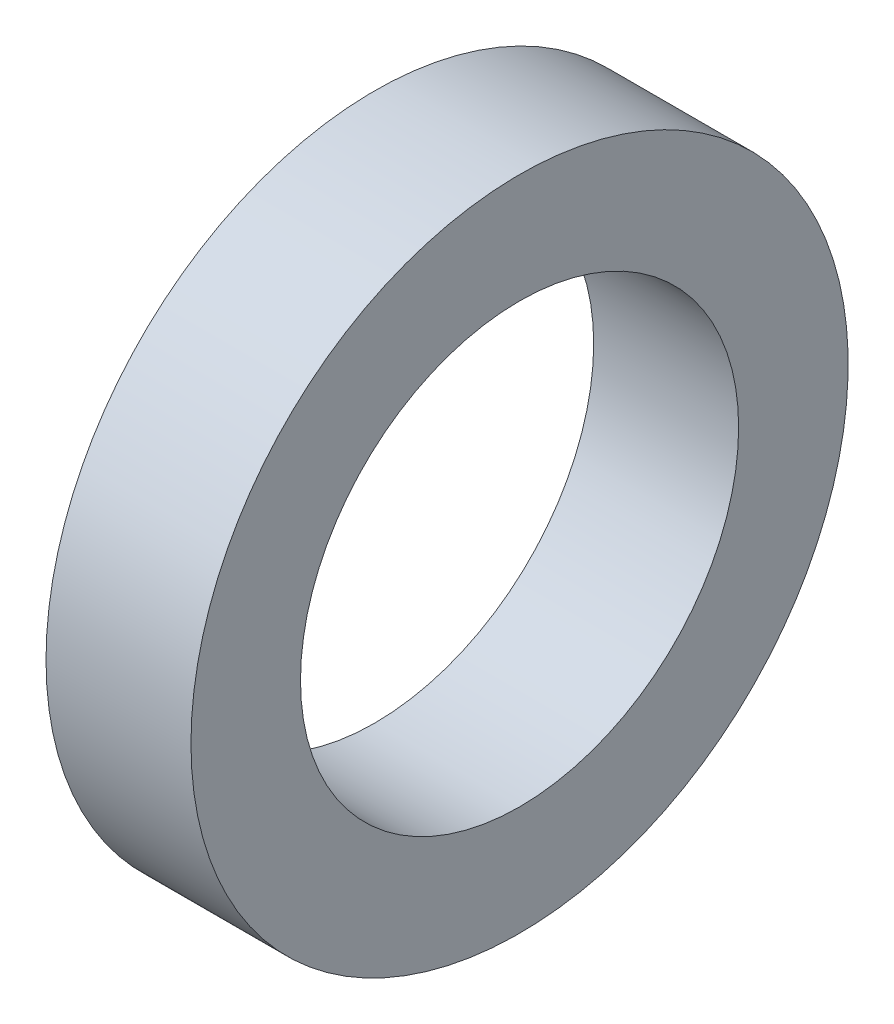
ISO-10303-21;
HEADER;
FILE_DESCRIPTION(('STEP AP214'),'2;1');
FILE_NAME('part.step','',(''),(''),'','','');
FILE_SCHEMA(('AUTOMOTIVE_DESIGN { 1 0 10303 214 1 1 1 1 }'));
ENDSEC;
DATA;
#1=APPLICATION_CONTEXT('core data for automotive mechanical design processes');
#2=APPLICATION_PROTOCOL_DEFINITION('international standard','automotive_design',2000,#1);
#3=PRODUCT_CONTEXT('',#1,'mechanical');
#4=PRODUCT('Part','Part','',(#3));
#5=PRODUCT_RELATED_PRODUCT_CATEGORY('part','',(#4));
#6=PRODUCT_DEFINITION_FORMATION('','',#4);
#7=PRODUCT_DEFINITION_CONTEXT('part definition',#1,'design');
#8=PRODUCT_DEFINITION('design','',#6,#7);
#9=PRODUCT_DEFINITION_SHAPE('','',#8);
#10=(LENGTH_UNIT() NAMED_UNIT(*) SI_UNIT(.MILLI.,.METRE.));
#11=(NAMED_UNIT(*) PLANE_ANGLE_UNIT() SI_UNIT($,.RADIAN.));
#12=(NAMED_UNIT(*) SI_UNIT($,.STERADIAN.) SOLID_ANGLE_UNIT());
#13=UNCERTAINTY_MEASURE_WITH_UNIT(LENGTH_MEASURE(1.E-05),#10,'distance_accuracy_value','');
#14=(GEOMETRIC_REPRESENTATION_CONTEXT(3) GLOBAL_UNCERTAINTY_ASSIGNED_CONTEXT((#13)) GLOBAL_UNIT_ASSIGNED_CONTEXT((#10,
#11,#12)) REPRESENTATION_CONTEXT('',''));
#15=CARTESIAN_POINT('',(0.,0.,0.));
#16=DIRECTION('',(0.,0.,1.));
#17=DIRECTION('',(1.,0.,0.));
#18=AXIS2_PLACEMENT_3D('',#15,#16,#17);
#19=CARTESIAN_POINT('',(6.009399716,5.999999938,0.));
#20=DIRECTION('',(1.,0.,0.));
#21=DIRECTION('',(0.,0.,-1.));
#22=AXIS2_PLACEMENT_3D('',#19,#20,#21);
#23=PLANE('',#22);
#24=CARTESIAN_POINT('',(6.009399716,0.,0.));
#25=DIRECTION('',(-1.,0.,0.));
#26=DIRECTION('',(0.,0.,1.));
#27=AXIS2_PLACEMENT_3D('',#24,#25,#26);
#28=CIRCLE('',#27,5.999999938);
#29=CARTESIAN_POINT('',(6.009399716,0.,5.999999938));
#30=VERTEX_POINT('',#29);
#31=EDGE_CURVE('E49',#30,#30,#28,.T.);
#32=ORIENTED_EDGE('',*,*,#31,.F.);
#33=EDGE_LOOP('',(#32));
#34=FACE_BOUND('',#33,.T.);
#35=CARTESIAN_POINT('',(6.009399716,0.,0.));
#36=DIRECTION('',(-1.,0.,0.));
#37=DIRECTION('',(0.,0.,1.));
#38=AXIS2_PLACEMENT_3D('',#35,#36,#37);
#39=CIRCLE('',#38,9.000000034);
#40=CARTESIAN_POINT('',(6.009399716,0.,9.000000034));
#41=VERTEX_POINT('',#40);
#42=EDGE_CURVE('E10',#41,#41,#39,.T.);
#43=ORIENTED_EDGE('',*,*,#42,.T.);
#44=EDGE_LOOP('',(#43));
#45=FACE_BOUND('',#44,.T.);
#46=ADVANCED_FACE('F35',(#34,#45),#23,.F.);
#47=CARTESIAN_POINT('',(0.,0.,0.));
#48=DIRECTION('',(-1.,0.,0.));
#49=DIRECTION('',(0.,0.,1.));
#50=AXIS2_PLACEMENT_3D('',#47,#48,#49);
#51=CYLINDRICAL_SURFACE('',#50,9.000000034);
#52=ORIENTED_EDGE('',*,*,#42,.F.);
#53=EDGE_LOOP('',(#52));
#54=FACE_BOUND('',#53,.T.);
#55=CARTESIAN_POINT('',(9.97939965,0.,0.));
#56=DIRECTION('',(-1.,0.,0.));
#57=DIRECTION('',(0.,0.,1.));
#58=AXIS2_PLACEMENT_3D('',#55,#56,#57);
#59=CIRCLE('',#58,9.000000034);
#60=CARTESIAN_POINT('',(9.97939965,0.,9.000000034));
#61=VERTEX_POINT('',#60);
#62=EDGE_CURVE('E41',#61,#61,#59,.T.);
#63=ORIENTED_EDGE('',*,*,#62,.T.);
#64=EDGE_LOOP('',(#63));
#65=FACE_BOUND('',#64,.T.);
#66=ADVANCED_FACE('F58',(#54,#65),#51,.T.);
#67=CARTESIAN_POINT('',(9.97939965,5.999999938,0.));
#68=DIRECTION('',(-1.,0.,0.));
#69=DIRECTION('',(0.,0.,1.));
#70=AXIS2_PLACEMENT_3D('',#67,#68,#69);
#71=PLANE('',#70);
#72=ORIENTED_EDGE('',*,*,#62,.F.);
#73=EDGE_LOOP('',(#72));
#74=FACE_BOUND('',#73,.T.);
#75=CARTESIAN_POINT('',(9.97939965,0.,0.));
#76=DIRECTION('',(-1.,0.,0.));
#77=DIRECTION('',(0.,0.,1.));
#78=AXIS2_PLACEMENT_3D('',#75,#76,#77);
#79=CIRCLE('',#78,5.999999938);
#80=CARTESIAN_POINT('',(9.97939965,0.,5.999999938));
#81=VERTEX_POINT('',#80);
#82=EDGE_CURVE('E45',#81,#81,#79,.T.);
#83=ORIENTED_EDGE('',*,*,#82,.T.);
#84=EDGE_LOOP('',(#83));
#85=FACE_BOUND('',#84,.T.);
#86=ADVANCED_FACE('F62',(#74,#85),#71,.F.);
#87=CARTESIAN_POINT('',(0.,0.,0.));
#88=DIRECTION('',(-1.,0.,0.));
#89=DIRECTION('',(0.,0.,1.));
#90=AXIS2_PLACEMENT_3D('',#87,#88,#89);
#91=CYLINDRICAL_SURFACE('',#90,5.999999938);
#92=ORIENTED_EDGE('',*,*,#82,.F.);
#93=EDGE_LOOP('',(#92));
#94=FACE_BOUND('',#93,.T.);
#95=ORIENTED_EDGE('',*,*,#31,.T.);
#96=EDGE_LOOP('',(#95));
#97=FACE_BOUND('',#96,.T.);
#98=ADVANCED_FACE('F55',(#94,#97),#91,.F.);
#99=CLOSED_SHELL('',(#46,#66,#86,#98));
#100=MANIFOLD_SOLID_BREP('B2',#99);
#101=ADVANCED_BREP_SHAPE_REPRESENTATION('',(#18,#100),#14);
#102=SHAPE_DEFINITION_REPRESENTATION(#9,#101);
ENDSEC;
END-ISO-10303-21;
